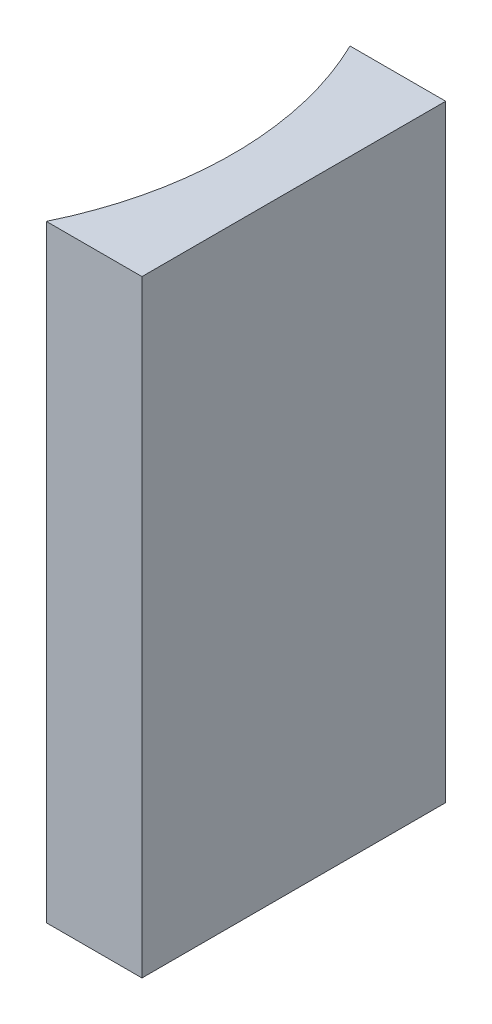
ISO-10303-21;
HEADER;
FILE_DESCRIPTION(('STEP AP214'),'2;1');
FILE_NAME('part.step','',(''),(''),'','','');
FILE_SCHEMA(('AUTOMOTIVE_DESIGN { 1 0 10303 214 1 1 1 1 }'));
ENDSEC;
DATA;
#1=APPLICATION_CONTEXT('core data for automotive mechanical design processes');
#2=APPLICATION_PROTOCOL_DEFINITION('international standard','automotive_design',2000,#1);
#3=PRODUCT_CONTEXT('',#1,'mechanical');
#4=PRODUCT('Part','Part','',(#3));
#5=PRODUCT_RELATED_PRODUCT_CATEGORY('part','',(#4));
#6=PRODUCT_DEFINITION_FORMATION('','',#4);
#7=PRODUCT_DEFINITION_CONTEXT('part definition',#1,'design');
#8=PRODUCT_DEFINITION('design','',#6,#7);
#9=PRODUCT_DEFINITION_SHAPE('','',#8);
#10=(LENGTH_UNIT() NAMED_UNIT(*) SI_UNIT(.MILLI.,.METRE.));
#11=(NAMED_UNIT(*) PLANE_ANGLE_UNIT() SI_UNIT($,.RADIAN.));
#12=(NAMED_UNIT(*) SI_UNIT($,.STERADIAN.) SOLID_ANGLE_UNIT());
#13=UNCERTAINTY_MEASURE_WITH_UNIT(LENGTH_MEASURE(1.E-05),#10,'distance_accuracy_value','');
#14=(GEOMETRIC_REPRESENTATION_CONTEXT(3) GLOBAL_UNCERTAINTY_ASSIGNED_CONTEXT((#13)) GLOBAL_UNIT_ASSIGNED_CONTEXT((#10,
#11,#12)) REPRESENTATION_CONTEXT('',''));
#15=CARTESIAN_POINT('',(0.,0.,0.));
#16=DIRECTION('',(0.,0.,1.));
#17=DIRECTION('',(1.,0.,0.));
#18=AXIS2_PLACEMENT_3D('',#15,#16,#17);
#19=CARTESIAN_POINT('',(0.,20.,0.));
#20=DIRECTION('',(0.,0.,1.));
#21=DIRECTION('',(1.,0.,0.));
#22=AXIS2_PLACEMENT_3D('',#19,#20,#21);
#23=PLANE('',#22);
#24=DIRECTION('',(-1.,0.,0.));
#25=VECTOR('',#24,1.);
#26=CARTESIAN_POINT('',(0.,0.,0.));
#27=LINE('',#26,#25);
#28=CARTESIAN_POINT('',(0.,0.,0.));
#29=VERTEX_POINT('',#28);
#30=CARTESIAN_POINT('',(-3.14939322175631,0.,0.));
#31=VERTEX_POINT('',#30);
#32=EDGE_CURVE('E98',#29,#31,#27,.T.);
#33=ORIENTED_EDGE('',*,*,#32,.T.);
#34=DIRECTION('',(0.,-1.,0.));
#35=VECTOR('',#34,1.);
#36=CARTESIAN_POINT('',(-3.14939322175631,20.,0.));
#37=LINE('',#36,#35);
#38=CARTESIAN_POINT('',(-3.14939322175631,20.,0.));
#39=VERTEX_POINT('',#38);
#40=EDGE_CURVE('E11',#39,#31,#37,.T.);
#41=ORIENTED_EDGE('',*,*,#40,.F.);
#42=DIRECTION('',(-1.,0.,0.));
#43=VECTOR('',#42,1.);
#44=CARTESIAN_POINT('',(0.,20.,0.));
#45=LINE('',#44,#43);
#46=CARTESIAN_POINT('',(0.,20.,0.));
#47=VERTEX_POINT('',#46);
#48=EDGE_CURVE('E86',#47,#39,#45,.T.);
#49=ORIENTED_EDGE('',*,*,#48,.F.);
#50=DIRECTION('',(0.,-1.,0.));
#51=VECTOR('',#50,1.);
#52=CARTESIAN_POINT('',(0.,20.,0.));
#53=LINE('',#52,#51);
#54=EDGE_CURVE('E94',#47,#29,#53,.T.);
#55=ORIENTED_EDGE('',*,*,#54,.T.);
#56=EDGE_LOOP('',(#33,#41,#49,#55));
#57=FACE_BOUND('',#56,.T.);
#58=ADVANCED_FACE('F35',(#57),#23,.F.);
#59=CARTESIAN_POINT('',(-13.45,20.,5.));
#60=DIRECTION('',(0.,-1.,0.));
#61=DIRECTION('',(0.,0.,-1.));
#62=AXIS2_PLACEMENT_3D('',#59,#60,#61);
#63=CYLINDRICAL_SURFACE('',#62,11.45);
#64=CARTESIAN_POINT('',(-13.45,0.,5.));
#65=DIRECTION('',(0.,-1.,0.));
#66=DIRECTION('',(0.,0.,1.));
#67=AXIS2_PLACEMENT_3D('',#64,#65,#66);
#68=CIRCLE('',#67,11.45);
#69=CARTESIAN_POINT('',(-3.1493932217563,0.,10.));
#70=VERTEX_POINT('',#69);
#71=EDGE_CURVE('E90',#31,#70,#68,.T.);
#72=ORIENTED_EDGE('',*,*,#71,.T.);
#73=DIRECTION('',(0.,-1.,0.));
#74=VECTOR('',#73,1.);
#75=CARTESIAN_POINT('',(-3.1493932217563,20.,10.));
#76=LINE('',#75,#74);
#77=CARTESIAN_POINT('',(-3.1493932217563,20.,10.));
#78=VERTEX_POINT('',#77);
#79=EDGE_CURVE('E43',#78,#70,#76,.T.);
#80=ORIENTED_EDGE('',*,*,#79,.F.);
#81=CARTESIAN_POINT('',(-13.45,20.,5.));
#82=DIRECTION('',(0.,-1.,0.));
#83=DIRECTION('',(0.,0.,1.));
#84=AXIS2_PLACEMENT_3D('',#81,#82,#83);
#85=CIRCLE('',#84,11.45);
#86=EDGE_CURVE('E81',#39,#78,#85,.T.);
#87=ORIENTED_EDGE('',*,*,#86,.F.);
#88=ORIENTED_EDGE('',*,*,#40,.T.);
#89=EDGE_LOOP('',(#72,#80,#87,#88));
#90=FACE_BOUND('',#89,.T.);
#91=ADVANCED_FACE('F89',(#90),#63,.F.);
#92=CARTESIAN_POINT('',(0.,20.,10.));
#93=DIRECTION('',(0.,0.,-1.));
#94=DIRECTION('',(-1.,0.,0.));
#95=AXIS2_PLACEMENT_3D('',#92,#93,#94);
#96=PLANE('',#95);
#97=DIRECTION('',(1.,0.,0.));
#98=VECTOR('',#97,1.);
#99=CARTESIAN_POINT('',(0.,0.,10.));
#100=LINE('',#99,#98);
#101=CARTESIAN_POINT('',(0.,0.,10.));
#102=VERTEX_POINT('',#101);
#103=EDGE_CURVE('E68',#70,#102,#100,.T.);
#104=ORIENTED_EDGE('',*,*,#103,.T.);
#105=DIRECTION('',(0.,-1.,0.));
#106=VECTOR('',#105,1.);
#107=CARTESIAN_POINT('',(0.,20.,10.));
#108=LINE('',#107,#106);
#109=CARTESIAN_POINT('',(0.,20.,10.));
#110=VERTEX_POINT('',#109);
#111=EDGE_CURVE('E91',#110,#102,#108,.T.);
#112=ORIENTED_EDGE('',*,*,#111,.F.);
#113=DIRECTION('',(1.,0.,0.));
#114=VECTOR('',#113,1.);
#115=CARTESIAN_POINT('',(0.,20.,10.));
#116=LINE('',#115,#114);
#117=EDGE_CURVE('E84',#78,#110,#116,.T.);
#118=ORIENTED_EDGE('',*,*,#117,.F.);
#119=ORIENTED_EDGE('',*,*,#79,.T.);
#120=EDGE_LOOP('',(#104,#112,#118,#119));
#121=FACE_BOUND('',#120,.T.);
#122=ADVANCED_FACE('F92',(#121),#96,.F.);
#123=CARTESIAN_POINT('',(0.,20.,0.));
#124=DIRECTION('',(-1.,0.,0.));
#125=DIRECTION('',(0.,0.,1.));
#126=AXIS2_PLACEMENT_3D('',#123,#124,#125);
#127=PLANE('',#126);
#128=DIRECTION('',(0.,0.,-1.));
#129=VECTOR('',#128,1.);
#130=CARTESIAN_POINT('',(0.,0.,0.));
#131=LINE('',#130,#129);
#132=EDGE_CURVE('E74',#102,#29,#131,.T.);
#133=ORIENTED_EDGE('',*,*,#132,.T.);
#134=ORIENTED_EDGE('',*,*,#54,.F.);
#135=DIRECTION('',(0.,0.,-1.));
#136=VECTOR('',#135,1.);
#137=CARTESIAN_POINT('',(0.,20.,0.));
#138=LINE('',#137,#136);
#139=EDGE_CURVE('E51',#110,#47,#138,.T.);
#140=ORIENTED_EDGE('',*,*,#139,.F.);
#141=ORIENTED_EDGE('',*,*,#111,.T.);
#142=EDGE_LOOP('',(#133,#134,#140,#141));
#143=FACE_BOUND('',#142,.T.);
#144=ADVANCED_FACE('F105',(#143),#127,.F.);
#145=CARTESIAN_POINT('',(-13.45,20.,5.));
#146=DIRECTION('',(0.,1.,0.));
#147=DIRECTION('',(0.,0.,1.));
#148=AXIS2_PLACEMENT_3D('',#145,#146,#147);
#149=PLANE('',#148);
#150=ORIENTED_EDGE('',*,*,#48,.T.);
#151=ORIENTED_EDGE('',*,*,#86,.T.);
#152=ORIENTED_EDGE('',*,*,#117,.T.);
#153=ORIENTED_EDGE('',*,*,#139,.T.);
#154=EDGE_LOOP('',(#150,#151,#152,#153));
#155=FACE_BOUND('',#154,.T.);
#156=ADVANCED_FACE('F82',(#155),#149,.T.);
#157=CARTESIAN_POINT('',(-13.45,0.,5.));
#158=DIRECTION('',(0.,1.,0.));
#159=DIRECTION('',(0.,0.,1.));
#160=AXIS2_PLACEMENT_3D('',#157,#158,#159);
#161=PLANE('',#160);
#162=ORIENTED_EDGE('',*,*,#32,.F.);
#163=ORIENTED_EDGE('',*,*,#132,.F.);
#164=ORIENTED_EDGE('',*,*,#103,.F.);
#165=ORIENTED_EDGE('',*,*,#71,.F.);
#166=EDGE_LOOP('',(#162,#163,#164,#165));
#167=FACE_BOUND('',#166,.T.);
#168=ADVANCED_FACE('F108',(#167),#161,.F.);
#169=CLOSED_SHELL('',(#58,#91,#122,#144,#156,#168));
#170=MANIFOLD_SOLID_BREP('B2',#169);
#171=ADVANCED_BREP_SHAPE_REPRESENTATION('',(#18,#170),#14);
#172=SHAPE_DEFINITION_REPRESENTATION(#9,#171);
ENDSEC;
END-ISO-10303-21;
